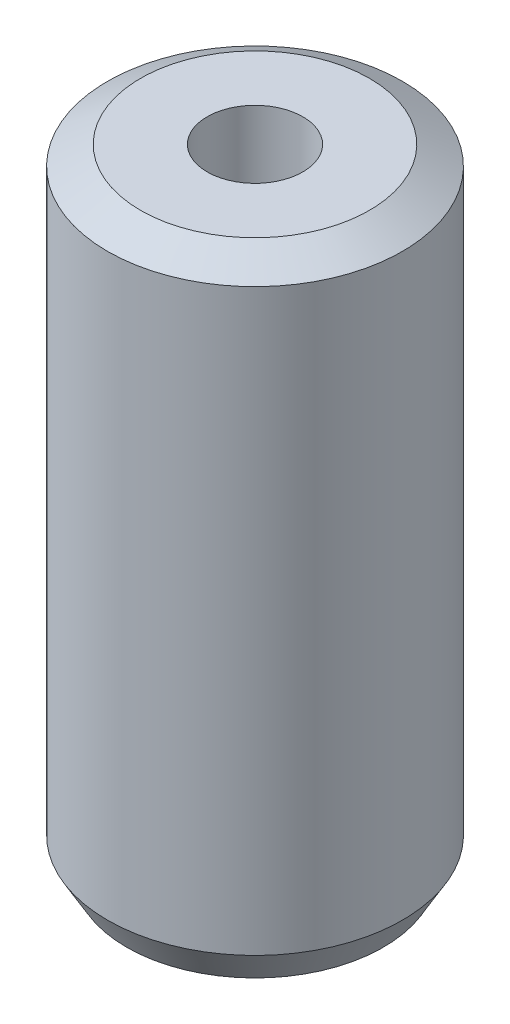
ISO-10303-21;
HEADER;
FILE_DESCRIPTION(('STEP AP214'),'2;1');
FILE_NAME('part.step','',(''),(''),'','','');
FILE_SCHEMA(('AUTOMOTIVE_DESIGN { 1 0 10303 214 1 1 1 1 }'));
ENDSEC;
DATA;
#1=APPLICATION_CONTEXT('core data for automotive mechanical design processes');
#2=APPLICATION_PROTOCOL_DEFINITION('international standard','automotive_design',2000,#1);
#3=PRODUCT_CONTEXT('',#1,'mechanical');
#4=PRODUCT('Part','Part','',(#3));
#5=PRODUCT_RELATED_PRODUCT_CATEGORY('part','',(#4));
#6=PRODUCT_DEFINITION_FORMATION('','',#4);
#7=PRODUCT_DEFINITION_CONTEXT('part definition',#1,'design');
#8=PRODUCT_DEFINITION('design','',#6,#7);
#9=PRODUCT_DEFINITION_SHAPE('','',#8);
#10=(LENGTH_UNIT() NAMED_UNIT(*) SI_UNIT(.MILLI.,.METRE.));
#11=(NAMED_UNIT(*) PLANE_ANGLE_UNIT() SI_UNIT($,.RADIAN.));
#12=(NAMED_UNIT(*) SI_UNIT($,.STERADIAN.) SOLID_ANGLE_UNIT());
#13=UNCERTAINTY_MEASURE_WITH_UNIT(LENGTH_MEASURE(1.E-05),#10,'distance_accuracy_value','');
#14=(GEOMETRIC_REPRESENTATION_CONTEXT(3) GLOBAL_UNCERTAINTY_ASSIGNED_CONTEXT((#13)) GLOBAL_UNIT_ASSIGNED_CONTEXT((#10,
#11,#12)) REPRESENTATION_CONTEXT('',''));
#15=CARTESIAN_POINT('',(0.,0.,0.));
#16=DIRECTION('',(0.,0.,1.));
#17=DIRECTION('',(1.,0.,0.));
#18=AXIS2_PLACEMENT_3D('',#15,#16,#17);
#19=CARTESIAN_POINT('',(0.,182.001182837804,0.));
#20=DIRECTION('',(0.,-1.,0.));
#21=DIRECTION('',(0.,0.,-1.));
#22=AXIS2_PLACEMENT_3D('',#19,#20,#21);
#23=CYLINDRICAL_SURFACE('',#22,42.5);
#24=CARTESIAN_POINT('',(0.,176.510983958911,0.));
#25=DIRECTION('',(0.,1.,0.));
#26=DIRECTION('',(0.,0.,1.));
#27=AXIS2_PLACEMENT_3D('',#24,#25,#26);
#28=CIRCLE('',#27,42.5);
#29=CARTESIAN_POINT('',(0.,176.510983958911,42.5));
#30=VERTEX_POINT('',#29);
#31=EDGE_CURVE('E50',#30,#30,#28,.F.);
#32=ORIENTED_EDGE('',*,*,#31,.T.);
#33=EDGE_LOOP('',(#32));
#34=FACE_BOUND('',#33,.T.);
#35=CARTESIAN_POINT('',(0.,9.50930340190093,0.));
#36=DIRECTION('',(0.,1.,0.));
#37=DIRECTION('',(0.,0.,1.));
#38=AXIS2_PLACEMENT_3D('',#35,#36,#37);
#39=CIRCLE('',#38,42.5);
#40=CARTESIAN_POINT('',(0.,9.50930340190093,42.5));
#41=VERTEX_POINT('',#40);
#42=EDGE_CURVE('E51',#41,#41,#39,.T.);
#43=ORIENTED_EDGE('',*,*,#42,.T.);
#44=EDGE_LOOP('',(#43));
#45=FACE_BOUND('',#44,.T.);
#46=ADVANCED_FACE('F39',(#34,#45),#23,.T.);
#47=CARTESIAN_POINT('',(0.,182.001182837804,0.));
#48=DIRECTION('',(0.,1.,0.));
#49=DIRECTION('',(0.,0.,1.));
#50=AXIS2_PLACEMENT_3D('',#47,#48,#49);
#51=PLANE('',#50);
#52=CARTESIAN_POINT('',(0.,182.001182837804,0.));
#53=DIRECTION('',(0.,1.,0.));
#54=DIRECTION('',(0.,0.,1.));
#55=AXIS2_PLACEMENT_3D('',#52,#53,#54);
#56=CIRCLE('',#55,32.9906965980991);
#57=CARTESIAN_POINT('',(0.,182.001182837804,32.9906965980991));
#58=VERTEX_POINT('',#57);
#59=EDGE_CURVE('E54',#58,#58,#56,.T.);
#60=ORIENTED_EDGE('',*,*,#59,.T.);
#61=EDGE_LOOP('',(#60));
#62=FACE_BOUND('',#61,.T.);
#63=CARTESIAN_POINT('',(0.,182.001182837804,0.));
#64=DIRECTION('',(0.,1.,0.));
#65=DIRECTION('',(0.,0.,1.));
#66=AXIS2_PLACEMENT_3D('',#63,#64,#65);
#67=CIRCLE('',#66,13.7905776436855);
#68=CARTESIAN_POINT('',(0.,182.001182837804,13.7905776436855));
#69=VERTEX_POINT('',#68);
#70=EDGE_CURVE('E58',#69,#69,#67,.T.);
#71=ORIENTED_EDGE('',*,*,#70,.F.);
#72=EDGE_LOOP('',(#71));
#73=FACE_BOUND('',#72,.T.);
#74=ADVANCED_FACE('F69',(#62,#73),#51,.T.);
#75=CARTESIAN_POINT('',(0.,0.,0.));
#76=DIRECTION('',(0.,1.,0.));
#77=DIRECTION('',(0.,0.,1.));
#78=AXIS2_PLACEMENT_3D('',#75,#76,#77);
#79=PLANE('',#78);
#80=CARTESIAN_POINT('',(0.,0.,0.));
#81=DIRECTION('',(0.,1.,0.));
#82=DIRECTION('',(0.,0.,1.));
#83=AXIS2_PLACEMENT_3D('',#80,#81,#82);
#84=CIRCLE('',#83,37.0098011211066);
#85=CARTESIAN_POINT('',(0.,0.,37.0098011211066));
#86=VERTEX_POINT('',#85);
#87=EDGE_CURVE('E10',#86,#86,#84,.F.);
#88=ORIENTED_EDGE('',*,*,#87,.T.);
#89=EDGE_LOOP('',(#88));
#90=FACE_BOUND('',#89,.T.);
#91=CARTESIAN_POINT('',(0.,0.,0.));
#92=DIRECTION('',(0.,1.,0.));
#93=DIRECTION('',(0.,0.,1.));
#94=AXIS2_PLACEMENT_3D('',#91,#92,#93);
#95=CIRCLE('',#94,13.7905776436855);
#96=CARTESIAN_POINT('',(0.,0.,13.7905776436855));
#97=VERTEX_POINT('',#96);
#98=EDGE_CURVE('E63',#97,#97,#95,.T.);
#99=ORIENTED_EDGE('',*,*,#98,.T.);
#100=EDGE_LOOP('',(#99));
#101=FACE_BOUND('',#100,.T.);
#102=ADVANCED_FACE('F75',(#90,#101),#79,.F.);
#103=CARTESIAN_POINT('',(0.,182.001182837804,0.));
#104=DIRECTION('',(0.,-1.,0.));
#105=DIRECTION('',(0.,0.,-1.));
#106=AXIS2_PLACEMENT_3D('',#103,#104,#105);
#107=CYLINDRICAL_SURFACE('',#106,13.7905776436855);
#108=ORIENTED_EDGE('',*,*,#70,.T.);
#109=EDGE_LOOP('',(#108));
#110=FACE_BOUND('',#109,.T.);
#111=ORIENTED_EDGE('',*,*,#98,.F.);
#112=EDGE_LOOP('',(#111));
#113=FACE_BOUND('',#112,.T.);
#114=ADVANCED_FACE('F70',(#110,#113),#107,.F.);
#115=CARTESIAN_POINT('',(0.,182.001182837804,0.));
#116=DIRECTION('',(0.,-1.,0.));
#117=DIRECTION('',(0.,0.,-1.));
#118=AXIS2_PLACEMENT_3D('',#115,#116,#117);
#119=CONICAL_SURFACE('',#118,32.9906965980991,1.04719755119659);
#120=ORIENTED_EDGE('',*,*,#31,.F.);
#121=EDGE_LOOP('',(#120));
#122=FACE_BOUND('',#121,.T.);
#123=ORIENTED_EDGE('',*,*,#59,.F.);
#124=EDGE_LOOP('',(#123));
#125=FACE_BOUND('',#124,.T.);
#126=ADVANCED_FACE('F81',(#122,#125),#119,.T.);
#127=CARTESIAN_POINT('',(0.,9.50930340190093,0.));
#128=DIRECTION('',(0.,1.,0.));
#129=DIRECTION('',(0.,0.,1.));
#130=AXIS2_PLACEMENT_3D('',#127,#128,#129);
#131=CONICAL_SURFACE('',#130,42.5,0.523598775598303);
#132=ORIENTED_EDGE('',*,*,#87,.F.);
#133=EDGE_LOOP('',(#132));
#134=FACE_BOUND('',#133,.T.);
#135=ORIENTED_EDGE('',*,*,#42,.F.);
#136=EDGE_LOOP('',(#135));
#137=FACE_BOUND('',#136,.T.);
#138=ADVANCED_FACE('F45',(#134,#137),#131,.T.);
#139=CLOSED_SHELL('',(#46,#74,#102,#114,#126,#138));
#140=MANIFOLD_SOLID_BREP('B2',#139);
#141=ADVANCED_BREP_SHAPE_REPRESENTATION('',(#18,#140),#14);
#142=SHAPE_DEFINITION_REPRESENTATION(#9,#141);
ENDSEC;
END-ISO-10303-21;
